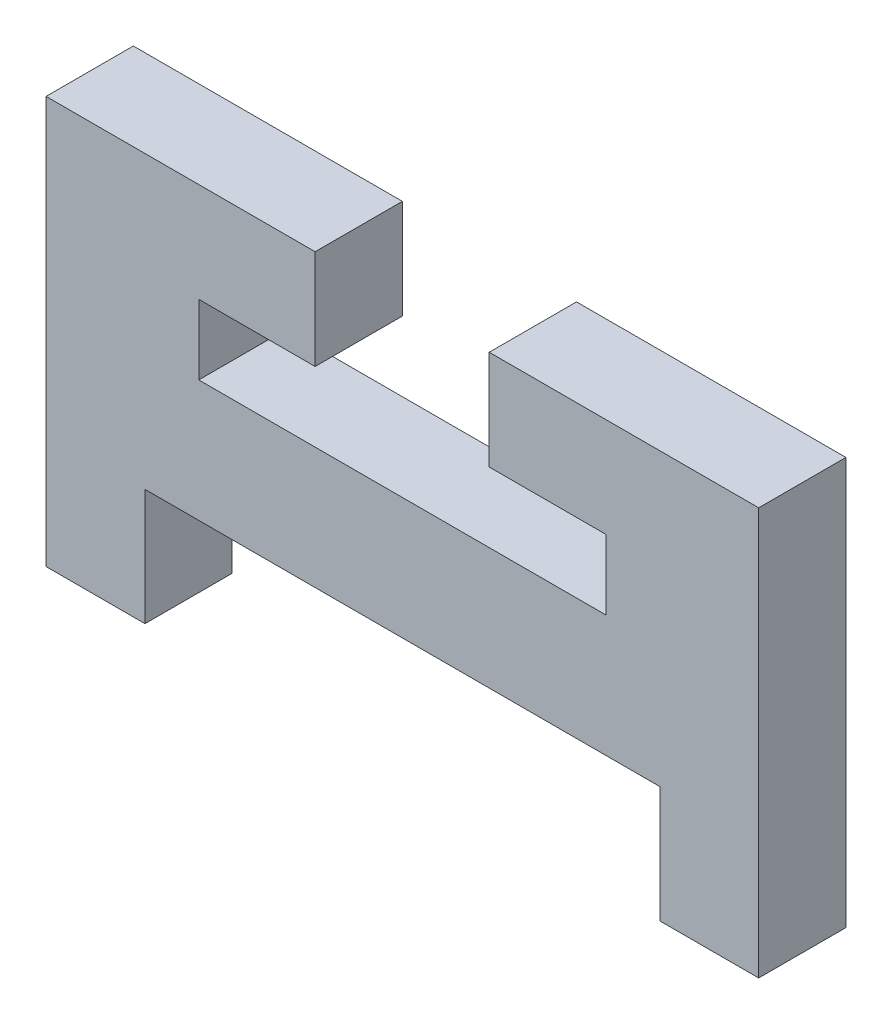
ISO-10303-21;
HEADER;
FILE_DESCRIPTION(('STEP AP214'),'2;1');
FILE_NAME('part.step','',(''),(''),'','','');
FILE_SCHEMA(('AUTOMOTIVE_DESIGN { 1 0 10303 214 1 1 1 1 }'));
ENDSEC;
DATA;
#1=APPLICATION_CONTEXT('core data for automotive mechanical design processes');
#2=APPLICATION_PROTOCOL_DEFINITION('international standard','automotive_design',2000,#1);
#3=PRODUCT_CONTEXT('',#1,'mechanical');
#4=PRODUCT('Part','Part','',(#3));
#5=PRODUCT_RELATED_PRODUCT_CATEGORY('part','',(#4));
#6=PRODUCT_DEFINITION_FORMATION('','',#4);
#7=PRODUCT_DEFINITION_CONTEXT('part definition',#1,'design');
#8=PRODUCT_DEFINITION('design','',#6,#7);
#9=PRODUCT_DEFINITION_SHAPE('','',#8);
#10=(LENGTH_UNIT() NAMED_UNIT(*) SI_UNIT(.MILLI.,.METRE.));
#11=(NAMED_UNIT(*) PLANE_ANGLE_UNIT() SI_UNIT($,.RADIAN.));
#12=(NAMED_UNIT(*) SI_UNIT($,.STERADIAN.) SOLID_ANGLE_UNIT());
#13=UNCERTAINTY_MEASURE_WITH_UNIT(LENGTH_MEASURE(1.E-05),#10,'distance_accuracy_value','');
#14=(GEOMETRIC_REPRESENTATION_CONTEXT(3) GLOBAL_UNCERTAINTY_ASSIGNED_CONTEXT((#13)) GLOBAL_UNIT_ASSIGNED_CONTEXT((#10,
#11,#12)) REPRESENTATION_CONTEXT('',''));
#15=CARTESIAN_POINT('',(0.,0.,0.));
#16=DIRECTION('',(0.,0.,1.));
#17=DIRECTION('',(1.,0.,0.));
#18=AXIS2_PLACEMENT_3D('',#15,#16,#17);
#19=CARTESIAN_POINT('',(46.92,30.0826832944775,3.));
#20=DIRECTION('',(0.,-1.,0.));
#21=DIRECTION('',(0.,0.,-1.));
#22=AXIS2_PLACEMENT_3D('',#19,#20,#21);
#23=PLANE('',#22);
#24=DIRECTION('',(-1.,0.,0.));
#25=VECTOR('',#24,1.);
#26=CARTESIAN_POINT('',(46.92,30.0826832944775,0.));
#27=LINE('',#26,#25);
#28=CARTESIAN_POINT('',(53.42,30.0826832944775,0.));
#29=VERTEX_POINT('',#28);
#30=CARTESIAN_POINT('',(39.42,30.0826832944775,0.));
#31=VERTEX_POINT('',#30);
#32=EDGE_CURVE('E109',#29,#31,#27,.T.);
#33=ORIENTED_EDGE('',*,*,#32,.T.);
#34=DIRECTION('',(0.,0.,-1.));
#35=VECTOR('',#34,1.);
#36=CARTESIAN_POINT('',(39.42,30.0826832944775,3.));
#37=LINE('',#36,#35);
#38=CARTESIAN_POINT('',(39.42,30.0826832944775,3.));
#39=VERTEX_POINT('',#38);
#40=EDGE_CURVE('E11',#39,#31,#37,.T.);
#41=ORIENTED_EDGE('',*,*,#40,.F.);
#42=DIRECTION('',(-1.,0.,0.));
#43=VECTOR('',#42,1.);
#44=CARTESIAN_POINT('',(53.42,30.0826832944775,3.));
#45=LINE('',#44,#43);
#46=CARTESIAN_POINT('',(53.42,30.0826832944775,3.));
#47=VERTEX_POINT('',#46);
#48=EDGE_CURVE('E115',#47,#39,#45,.T.);
#49=ORIENTED_EDGE('',*,*,#48,.F.);
#50=DIRECTION('',(0.,0.,-1.));
#51=VECTOR('',#50,1.);
#52=CARTESIAN_POINT('',(53.42,30.0826832944775,3.));
#53=LINE('',#52,#51);
#54=EDGE_CURVE('E173',#47,#29,#53,.T.);
#55=ORIENTED_EDGE('',*,*,#54,.T.);
#56=EDGE_LOOP('',(#33,#41,#49,#55));
#57=FACE_BOUND('',#56,.T.);
#58=ADVANCED_FACE('F33',(#57),#23,.F.);
#59=CARTESIAN_POINT('',(39.42,30.0826832944775,3.));
#60=DIRECTION('',(-1.,0.,0.));
#61=DIRECTION('',(0.,0.,1.));
#62=AXIS2_PLACEMENT_3D('',#59,#60,#61);
#63=PLANE('',#62);
#64=DIRECTION('',(0.,1.,0.));
#65=VECTOR('',#64,1.);
#66=CARTESIAN_POINT('',(39.42,30.0826832944775,0.));
#67=LINE('',#66,#65);
#68=CARTESIAN_POINT('',(39.42,32.4826832944775,0.));
#69=VERTEX_POINT('',#68);
#70=EDGE_CURVE('E178',#31,#69,#67,.T.);
#71=ORIENTED_EDGE('',*,*,#70,.T.);
#72=DIRECTION('',(0.,0.,-1.));
#73=VECTOR('',#72,1.);
#74=CARTESIAN_POINT('',(39.42,32.4826832944775,3.));
#75=LINE('',#74,#73);
#76=CARTESIAN_POINT('',(39.42,32.4826832944775,3.));
#77=VERTEX_POINT('',#76);
#78=EDGE_CURVE('E41',#77,#69,#75,.T.);
#79=ORIENTED_EDGE('',*,*,#78,.F.);
#80=DIRECTION('',(0.,1.,0.));
#81=VECTOR('',#80,1.);
#82=CARTESIAN_POINT('',(39.42,30.0826832944775,3.));
#83=LINE('',#82,#81);
#84=EDGE_CURVE('E294',#39,#77,#83,.T.);
#85=ORIENTED_EDGE('',*,*,#84,.F.);
#86=ORIENTED_EDGE('',*,*,#40,.T.);
#87=EDGE_LOOP('',(#71,#79,#85,#86));
#88=FACE_BOUND('',#87,.T.);
#89=ADVANCED_FACE('F297',(#88),#63,.F.);
#90=CARTESIAN_POINT('',(39.42,32.4826832944775,3.));
#91=DIRECTION('',(0.,1.,0.));
#92=DIRECTION('',(0.,0.,1.));
#93=AXIS2_PLACEMENT_3D('',#90,#91,#92);
#94=PLANE('',#93);
#95=DIRECTION('',(1.,0.,0.));
#96=VECTOR('',#95,1.);
#97=CARTESIAN_POINT('',(39.42,32.4826832944775,0.));
#98=LINE('',#97,#96);
#99=CARTESIAN_POINT('',(43.42,32.4826832944775,0.));
#100=VERTEX_POINT('',#99);
#101=EDGE_CURVE('E180',#69,#100,#98,.T.);
#102=ORIENTED_EDGE('',*,*,#101,.T.);
#103=DIRECTION('',(0.,0.,-1.));
#104=VECTOR('',#103,1.);
#105=CARTESIAN_POINT('',(43.42,32.4826832944775,3.));
#106=LINE('',#105,#104);
#107=CARTESIAN_POINT('',(43.42,32.4826832944775,3.));
#108=VERTEX_POINT('',#107);
#109=EDGE_CURVE('E237',#108,#100,#106,.T.);
#110=ORIENTED_EDGE('',*,*,#109,.F.);
#111=DIRECTION('',(1.,0.,0.));
#112=VECTOR('',#111,1.);
#113=CARTESIAN_POINT('',(39.42,32.4826832944775,3.));
#114=LINE('',#113,#112);
#115=EDGE_CURVE('E246',#77,#108,#114,.T.);
#116=ORIENTED_EDGE('',*,*,#115,.F.);
#117=ORIENTED_EDGE('',*,*,#78,.T.);
#118=EDGE_LOOP('',(#102,#110,#116,#117));
#119=FACE_BOUND('',#118,.T.);
#120=ADVANCED_FACE('F244',(#119),#94,.F.);
#121=CARTESIAN_POINT('',(43.42,32.4826832944775,3.));
#122=DIRECTION('',(-1.,0.,0.));
#123=DIRECTION('',(0.,0.,1.));
#124=AXIS2_PLACEMENT_3D('',#121,#122,#123);
#125=PLANE('',#124);
#126=DIRECTION('',(0.,1.,0.));
#127=VECTOR('',#126,1.);
#128=CARTESIAN_POINT('',(43.42,32.4826832944775,0.));
#129=LINE('',#128,#127);
#130=CARTESIAN_POINT('',(43.42,35.9,0.));
#131=VERTEX_POINT('',#130);
#132=EDGE_CURVE('E182',#100,#131,#129,.T.);
#133=ORIENTED_EDGE('',*,*,#132,.T.);
#134=DIRECTION('',(0.,0.,-1.));
#135=VECTOR('',#134,1.);
#136=CARTESIAN_POINT('',(43.42,35.9,3.));
#137=LINE('',#136,#135);
#138=CARTESIAN_POINT('',(43.42,35.9,3.));
#139=VERTEX_POINT('',#138);
#140=EDGE_CURVE('E234',#139,#131,#137,.T.);
#141=ORIENTED_EDGE('',*,*,#140,.F.);
#142=DIRECTION('',(0.,1.,0.));
#143=VECTOR('',#142,1.);
#144=CARTESIAN_POINT('',(43.42,32.4826832944775,3.));
#145=LINE('',#144,#143);
#146=EDGE_CURVE('E264',#108,#139,#145,.T.);
#147=ORIENTED_EDGE('',*,*,#146,.F.);
#148=ORIENTED_EDGE('',*,*,#109,.T.);
#149=EDGE_LOOP('',(#133,#141,#147,#148));
#150=FACE_BOUND('',#149,.T.);
#151=ADVANCED_FACE('F255',(#150),#125,.F.);
#152=CARTESIAN_POINT('',(43.42,35.9,3.));
#153=DIRECTION('',(0.,-1.,0.));
#154=DIRECTION('',(0.,0.,-1.));
#155=AXIS2_PLACEMENT_3D('',#152,#153,#154);
#156=PLANE('',#155);
#157=DIRECTION('',(-1.,0.,0.));
#158=VECTOR('',#157,1.);
#159=CARTESIAN_POINT('',(43.42,35.9,0.));
#160=LINE('',#159,#158);
#161=CARTESIAN_POINT('',(34.17,35.9,0.));
#162=VERTEX_POINT('',#161);
#163=EDGE_CURVE('E184',#131,#162,#160,.T.);
#164=ORIENTED_EDGE('',*,*,#163,.T.);
#165=DIRECTION('',(0.,0.,-1.));
#166=VECTOR('',#165,1.);
#167=CARTESIAN_POINT('',(34.17,35.9,3.));
#168=LINE('',#167,#166);
#169=CARTESIAN_POINT('',(34.17,35.9,3.));
#170=VERTEX_POINT('',#169);
#171=EDGE_CURVE('E231',#170,#162,#168,.T.);
#172=ORIENTED_EDGE('',*,*,#171,.F.);
#173=DIRECTION('',(-1.,0.,0.));
#174=VECTOR('',#173,1.);
#175=CARTESIAN_POINT('',(43.42,35.9,3.));
#176=LINE('',#175,#174);
#177=EDGE_CURVE('E261',#139,#170,#176,.T.);
#178=ORIENTED_EDGE('',*,*,#177,.F.);
#179=ORIENTED_EDGE('',*,*,#140,.T.);
#180=EDGE_LOOP('',(#164,#172,#178,#179));
#181=FACE_BOUND('',#180,.T.);
#182=ADVANCED_FACE('F259',(#181),#156,.F.);
#183=CARTESIAN_POINT('',(34.17,35.9,3.));
#184=DIRECTION('',(1.,0.,0.));
#185=DIRECTION('',(0.,0.,-1.));
#186=AXIS2_PLACEMENT_3D('',#183,#184,#185);
#187=PLANE('',#186);
#188=DIRECTION('',(0.,-1.,0.));
#189=VECTOR('',#188,1.);
#190=CARTESIAN_POINT('',(34.17,35.9,0.));
#191=LINE('',#190,#189);
#192=CARTESIAN_POINT('',(34.17,21.9,0.));
#193=VERTEX_POINT('',#192);
#194=EDGE_CURVE('E186',#162,#193,#191,.T.);
#195=ORIENTED_EDGE('',*,*,#194,.T.);
#196=DIRECTION('',(0.,0.,-1.));
#197=VECTOR('',#196,1.);
#198=CARTESIAN_POINT('',(34.17,21.9,3.));
#199=LINE('',#198,#197);
#200=CARTESIAN_POINT('',(34.17,21.9,3.));
#201=VERTEX_POINT('',#200);
#202=EDGE_CURVE('E228',#201,#193,#199,.T.);
#203=ORIENTED_EDGE('',*,*,#202,.F.);
#204=DIRECTION('',(0.,-1.,0.));
#205=VECTOR('',#204,1.);
#206=CARTESIAN_POINT('',(34.17,35.9,3.));
#207=LINE('',#206,#205);
#208=EDGE_CURVE('E263',#170,#201,#207,.T.);
#209=ORIENTED_EDGE('',*,*,#208,.F.);
#210=ORIENTED_EDGE('',*,*,#171,.T.);
#211=EDGE_LOOP('',(#195,#203,#209,#210));
#212=FACE_BOUND('',#211,.T.);
#213=ADVANCED_FACE('F309',(#212),#187,.F.);
#214=CARTESIAN_POINT('',(34.17,21.9,3.));
#215=DIRECTION('',(0.,1.,0.));
#216=DIRECTION('',(0.,0.,1.));
#217=AXIS2_PLACEMENT_3D('',#214,#215,#216);
#218=PLANE('',#217);
#219=DIRECTION('',(1.,0.,0.));
#220=VECTOR('',#219,1.);
#221=CARTESIAN_POINT('',(34.17,21.9,0.));
#222=LINE('',#221,#220);
#223=CARTESIAN_POINT('',(37.57,21.9,0.));
#224=VERTEX_POINT('',#223);
#225=EDGE_CURVE('E188',#193,#224,#222,.T.);
#226=ORIENTED_EDGE('',*,*,#225,.T.);
#227=DIRECTION('',(0.,0.,-1.));
#228=VECTOR('',#227,1.);
#229=CARTESIAN_POINT('',(37.57,21.9,3.));
#230=LINE('',#229,#228);
#231=CARTESIAN_POINT('',(37.57,21.9,3.));
#232=VERTEX_POINT('',#231);
#233=EDGE_CURVE('E225',#232,#224,#230,.T.);
#234=ORIENTED_EDGE('',*,*,#233,.F.);
#235=DIRECTION('',(1.,0.,0.));
#236=VECTOR('',#235,1.);
#237=CARTESIAN_POINT('',(34.17,21.9,3.));
#238=LINE('',#237,#236);
#239=EDGE_CURVE('E266',#201,#232,#238,.T.);
#240=ORIENTED_EDGE('',*,*,#239,.F.);
#241=ORIENTED_EDGE('',*,*,#202,.T.);
#242=EDGE_LOOP('',(#226,#234,#240,#241));
#243=FACE_BOUND('',#242,.T.);
#244=ADVANCED_FACE('F312',(#243),#218,.F.);
#245=CARTESIAN_POINT('',(37.57,21.9,3.));
#246=DIRECTION('',(-1.,0.,0.));
#247=DIRECTION('',(0.,0.,1.));
#248=AXIS2_PLACEMENT_3D('',#245,#246,#247);
#249=PLANE('',#248);
#250=DIRECTION('',(0.,1.,0.));
#251=VECTOR('',#250,1.);
#252=CARTESIAN_POINT('',(37.57,21.9,0.));
#253=LINE('',#252,#251);
#254=CARTESIAN_POINT('',(37.57,25.9,0.));
#255=VERTEX_POINT('',#254);
#256=EDGE_CURVE('E190',#224,#255,#253,.T.);
#257=ORIENTED_EDGE('',*,*,#256,.T.);
#258=DIRECTION('',(0.,0.,-1.));
#259=VECTOR('',#258,1.);
#260=CARTESIAN_POINT('',(37.57,25.9,3.));
#261=LINE('',#260,#259);
#262=CARTESIAN_POINT('',(37.57,25.9,3.));
#263=VERTEX_POINT('',#262);
#264=EDGE_CURVE('E222',#263,#255,#261,.T.);
#265=ORIENTED_EDGE('',*,*,#264,.F.);
#266=DIRECTION('',(0.,1.,0.));
#267=VECTOR('',#266,1.);
#268=CARTESIAN_POINT('',(37.57,21.9,3.));
#269=LINE('',#268,#267);
#270=EDGE_CURVE('E272',#232,#263,#269,.T.);
#271=ORIENTED_EDGE('',*,*,#270,.F.);
#272=ORIENTED_EDGE('',*,*,#233,.T.);
#273=EDGE_LOOP('',(#257,#265,#271,#272));
#274=FACE_BOUND('',#273,.T.);
#275=ADVANCED_FACE('F316',(#274),#249,.F.);
#276=CARTESIAN_POINT('',(37.57,25.9,3.));
#277=DIRECTION('',(0.,1.,0.));
#278=DIRECTION('',(0.,0.,1.));
#279=AXIS2_PLACEMENT_3D('',#276,#277,#278);
#280=PLANE('',#279);
#281=DIRECTION('',(1.,0.,0.));
#282=VECTOR('',#281,1.);
#283=CARTESIAN_POINT('',(37.57,25.9,0.));
#284=LINE('',#283,#282);
#285=CARTESIAN_POINT('',(55.27,25.9,0.));
#286=VERTEX_POINT('',#285);
#287=EDGE_CURVE('E192',#255,#286,#284,.T.);
#288=ORIENTED_EDGE('',*,*,#287,.T.);
#289=DIRECTION('',(0.,0.,-1.));
#290=VECTOR('',#289,1.);
#291=CARTESIAN_POINT('',(55.27,25.9,3.));
#292=LINE('',#291,#290);
#293=CARTESIAN_POINT('',(55.27,25.9,3.));
#294=VERTEX_POINT('',#293);
#295=EDGE_CURVE('E219',#294,#286,#292,.T.);
#296=ORIENTED_EDGE('',*,*,#295,.F.);
#297=DIRECTION('',(1.,0.,0.));
#298=VECTOR('',#297,1.);
#299=CARTESIAN_POINT('',(37.57,25.9,3.));
#300=LINE('',#299,#298);
#301=EDGE_CURVE('E274',#263,#294,#300,.T.);
#302=ORIENTED_EDGE('',*,*,#301,.F.);
#303=ORIENTED_EDGE('',*,*,#264,.T.);
#304=EDGE_LOOP('',(#288,#296,#302,#303));
#305=FACE_BOUND('',#304,.T.);
#306=ADVANCED_FACE('F320',(#305),#280,.F.);
#307=CARTESIAN_POINT('',(55.27,25.9,3.));
#308=DIRECTION('',(1.,0.,0.));
#309=DIRECTION('',(0.,0.,-1.));
#310=AXIS2_PLACEMENT_3D('',#307,#308,#309);
#311=PLANE('',#310);
#312=DIRECTION('',(0.,-1.,0.));
#313=VECTOR('',#312,1.);
#314=CARTESIAN_POINT('',(55.27,25.9,0.));
#315=LINE('',#314,#313);
#316=CARTESIAN_POINT('',(55.27,21.9,0.));
#317=VERTEX_POINT('',#316);
#318=EDGE_CURVE('E194',#286,#317,#315,.T.);
#319=ORIENTED_EDGE('',*,*,#318,.T.);
#320=DIRECTION('',(0.,0.,-1.));
#321=VECTOR('',#320,1.);
#322=CARTESIAN_POINT('',(55.27,21.9,3.));
#323=LINE('',#322,#321);
#324=CARTESIAN_POINT('',(55.27,21.9,3.));
#325=VERTEX_POINT('',#324);
#326=EDGE_CURVE('E216',#325,#317,#323,.T.);
#327=ORIENTED_EDGE('',*,*,#326,.F.);
#328=DIRECTION('',(0.,-1.,0.));
#329=VECTOR('',#328,1.);
#330=CARTESIAN_POINT('',(55.27,25.9,3.));
#331=LINE('',#330,#329);
#332=EDGE_CURVE('E276',#294,#325,#331,.T.);
#333=ORIENTED_EDGE('',*,*,#332,.F.);
#334=ORIENTED_EDGE('',*,*,#295,.T.);
#335=EDGE_LOOP('',(#319,#327,#333,#334));
#336=FACE_BOUND('',#335,.T.);
#337=ADVANCED_FACE('F324',(#336),#311,.F.);
#338=CARTESIAN_POINT('',(55.27,21.9,3.));
#339=DIRECTION('',(0.,1.,0.));
#340=DIRECTION('',(0.,0.,1.));
#341=AXIS2_PLACEMENT_3D('',#338,#339,#340);
#342=PLANE('',#341);
#343=DIRECTION('',(1.,0.,0.));
#344=VECTOR('',#343,1.);
#345=CARTESIAN_POINT('',(55.27,21.9,0.));
#346=LINE('',#345,#344);
#347=CARTESIAN_POINT('',(58.67,21.9,0.));
#348=VERTEX_POINT('',#347);
#349=EDGE_CURVE('E196',#317,#348,#346,.T.);
#350=ORIENTED_EDGE('',*,*,#349,.T.);
#351=DIRECTION('',(0.,0.,-1.));
#352=VECTOR('',#351,1.);
#353=CARTESIAN_POINT('',(58.67,21.9,3.));
#354=LINE('',#353,#352);
#355=CARTESIAN_POINT('',(58.67,21.9,3.));
#356=VERTEX_POINT('',#355);
#357=EDGE_CURVE('E213',#356,#348,#354,.T.);
#358=ORIENTED_EDGE('',*,*,#357,.F.);
#359=DIRECTION('',(1.,0.,0.));
#360=VECTOR('',#359,1.);
#361=CARTESIAN_POINT('',(55.27,21.9,3.));
#362=LINE('',#361,#360);
#363=EDGE_CURVE('E278',#325,#356,#362,.T.);
#364=ORIENTED_EDGE('',*,*,#363,.F.);
#365=ORIENTED_EDGE('',*,*,#326,.T.);
#366=EDGE_LOOP('',(#350,#358,#364,#365));
#367=FACE_BOUND('',#366,.T.);
#368=ADVANCED_FACE('F328',(#367),#342,.F.);
#369=CARTESIAN_POINT('',(58.67,21.9,3.));
#370=DIRECTION('',(-1.,0.,0.));
#371=DIRECTION('',(0.,0.,1.));
#372=AXIS2_PLACEMENT_3D('',#369,#370,#371);
#373=PLANE('',#372);
#374=DIRECTION('',(0.,1.,0.));
#375=VECTOR('',#374,1.);
#376=CARTESIAN_POINT('',(58.67,21.9,0.));
#377=LINE('',#376,#375);
#378=CARTESIAN_POINT('',(58.67,35.9,0.));
#379=VERTEX_POINT('',#378);
#380=EDGE_CURVE('E198',#348,#379,#377,.T.);
#381=ORIENTED_EDGE('',*,*,#380,.T.);
#382=DIRECTION('',(0.,0.,-1.));
#383=VECTOR('',#382,1.);
#384=CARTESIAN_POINT('',(58.67,35.9,3.));
#385=LINE('',#384,#383);
#386=CARTESIAN_POINT('',(58.67,35.9,3.));
#387=VERTEX_POINT('',#386);
#388=EDGE_CURVE('E210',#387,#379,#385,.T.);
#389=ORIENTED_EDGE('',*,*,#388,.F.);
#390=DIRECTION('',(0.,1.,0.));
#391=VECTOR('',#390,1.);
#392=CARTESIAN_POINT('',(58.67,21.9,3.));
#393=LINE('',#392,#391);
#394=EDGE_CURVE('E280',#356,#387,#393,.T.);
#395=ORIENTED_EDGE('',*,*,#394,.F.);
#396=ORIENTED_EDGE('',*,*,#357,.T.);
#397=EDGE_LOOP('',(#381,#389,#395,#396));
#398=FACE_BOUND('',#397,.T.);
#399=ADVANCED_FACE('F286',(#398),#373,.F.);
#400=CARTESIAN_POINT('',(58.67,35.9,3.));
#401=DIRECTION('',(0.,-1.,0.));
#402=DIRECTION('',(0.,0.,-1.));
#403=AXIS2_PLACEMENT_3D('',#400,#401,#402);
#404=PLANE('',#403);
#405=DIRECTION('',(-1.,0.,0.));
#406=VECTOR('',#405,1.);
#407=CARTESIAN_POINT('',(58.67,35.9,0.));
#408=LINE('',#407,#406);
#409=CARTESIAN_POINT('',(49.4063854020223,35.9,0.));
#410=VERTEX_POINT('',#409);
#411=EDGE_CURVE('E200',#379,#410,#408,.T.);
#412=ORIENTED_EDGE('',*,*,#411,.T.);
#413=DIRECTION('',(0.,0.,-1.));
#414=VECTOR('',#413,1.);
#415=CARTESIAN_POINT('',(49.4063854020223,35.9,3.));
#416=LINE('',#415,#414);
#417=CARTESIAN_POINT('',(49.4063854020223,35.9,3.));
#418=VERTEX_POINT('',#417);
#419=EDGE_CURVE('E168',#418,#410,#416,.T.);
#420=ORIENTED_EDGE('',*,*,#419,.F.);
#421=DIRECTION('',(-1.,0.,0.));
#422=VECTOR('',#421,1.);
#423=CARTESIAN_POINT('',(58.67,35.9,3.));
#424=LINE('',#423,#422);
#425=EDGE_CURVE('E159',#387,#418,#424,.T.);
#426=ORIENTED_EDGE('',*,*,#425,.F.);
#427=ORIENTED_EDGE('',*,*,#388,.T.);
#428=EDGE_LOOP('',(#412,#420,#426,#427));
#429=FACE_BOUND('',#428,.T.);
#430=ADVANCED_FACE('F290',(#429),#404,.F.);
#431=CARTESIAN_POINT('',(49.4063854020223,35.9,3.));
#432=DIRECTION('',(1.,0.,0.));
#433=DIRECTION('',(0.,0.,-1.));
#434=AXIS2_PLACEMENT_3D('',#431,#432,#433);
#435=PLANE('',#434);
#436=DIRECTION('',(0.,-1.,0.));
#437=VECTOR('',#436,1.);
#438=CARTESIAN_POINT('',(49.4063854020223,35.9,0.));
#439=LINE('',#438,#437);
#440=CARTESIAN_POINT('',(49.4063854020223,32.4826832944775,0.));
#441=VERTEX_POINT('',#440);
#442=EDGE_CURVE('E167',#410,#441,#439,.T.);
#443=ORIENTED_EDGE('',*,*,#442,.T.);
#444=DIRECTION('',(0.,0.,-1.));
#445=VECTOR('',#444,1.);
#446=CARTESIAN_POINT('',(49.4063854020223,32.4826832944775,3.));
#447=LINE('',#446,#445);
#448=CARTESIAN_POINT('',(49.4063854020223,32.4826832944775,3.));
#449=VERTEX_POINT('',#448);
#450=EDGE_CURVE('E164',#449,#441,#447,.T.);
#451=ORIENTED_EDGE('',*,*,#450,.F.);
#452=DIRECTION('',(0.,-1.,0.));
#453=VECTOR('',#452,1.);
#454=CARTESIAN_POINT('',(49.4063854020223,35.9,3.));
#455=LINE('',#454,#453);
#456=EDGE_CURVE('E153',#418,#449,#455,.T.);
#457=ORIENTED_EDGE('',*,*,#456,.F.);
#458=ORIENTED_EDGE('',*,*,#419,.T.);
#459=EDGE_LOOP('',(#443,#451,#457,#458));
#460=FACE_BOUND('',#459,.T.);
#461=ADVANCED_FACE('F165',(#460),#435,.F.);
#462=CARTESIAN_POINT('',(49.4063854020223,32.4826832944775,3.));
#463=DIRECTION('',(0.,1.,0.));
#464=DIRECTION('',(0.,0.,1.));
#465=AXIS2_PLACEMENT_3D('',#462,#463,#464);
#466=PLANE('',#465);
#467=DIRECTION('',(1.,0.,0.));
#468=VECTOR('',#467,1.);
#469=CARTESIAN_POINT('',(49.4063854020223,32.4826832944775,0.));
#470=LINE('',#469,#468);
#471=CARTESIAN_POINT('',(53.42,32.4826832944775,0.));
#472=VERTEX_POINT('',#471);
#473=EDGE_CURVE('E102',#441,#472,#470,.T.);
#474=ORIENTED_EDGE('',*,*,#473,.T.);
#475=DIRECTION('',(0.,0.,-1.));
#476=VECTOR('',#475,1.);
#477=CARTESIAN_POINT('',(53.42,32.4826832944775,3.));
#478=LINE('',#477,#476);
#479=CARTESIAN_POINT('',(53.42,32.4826832944775,3.));
#480=VERTEX_POINT('',#479);
#481=EDGE_CURVE('E169',#480,#472,#478,.T.);
#482=ORIENTED_EDGE('',*,*,#481,.F.);
#483=DIRECTION('',(1.,0.,0.));
#484=VECTOR('',#483,1.);
#485=CARTESIAN_POINT('',(49.4063854020223,32.4826832944775,3.));
#486=LINE('',#485,#484);
#487=EDGE_CURVE('E157',#449,#480,#486,.T.);
#488=ORIENTED_EDGE('',*,*,#487,.F.);
#489=ORIENTED_EDGE('',*,*,#450,.T.);
#490=EDGE_LOOP('',(#474,#482,#488,#489));
#491=FACE_BOUND('',#490,.T.);
#492=ADVANCED_FACE('F171',(#491),#466,.F.);
#493=CARTESIAN_POINT('',(53.42,32.4826832944775,3.));
#494=DIRECTION('',(1.,0.,0.));
#495=DIRECTION('',(0.,0.,-1.));
#496=AXIS2_PLACEMENT_3D('',#493,#494,#495);
#497=PLANE('',#496);
#498=DIRECTION('',(0.,-1.,0.));
#499=VECTOR('',#498,1.);
#500=CARTESIAN_POINT('',(53.42,32.4826832944775,0.));
#501=LINE('',#500,#499);
#502=EDGE_CURVE('E204',#472,#29,#501,.T.);
#503=ORIENTED_EDGE('',*,*,#502,.T.);
#504=ORIENTED_EDGE('',*,*,#54,.F.);
#505=DIRECTION('',(0.,-1.,0.));
#506=VECTOR('',#505,1.);
#507=CARTESIAN_POINT('',(53.42,32.4826832944775,3.));
#508=LINE('',#507,#506);
#509=EDGE_CURVE('E49',#480,#47,#508,.T.);
#510=ORIENTED_EDGE('',*,*,#509,.F.);
#511=ORIENTED_EDGE('',*,*,#481,.T.);
#512=EDGE_LOOP('',(#503,#504,#510,#511));
#513=FACE_BOUND('',#512,.T.);
#514=ADVANCED_FACE('F292',(#513),#497,.F.);
#515=CARTESIAN_POINT('',(0.,0.,3.));
#516=DIRECTION('',(0.,0.,-1.));
#517=DIRECTION('',(-1.,0.,0.));
#518=AXIS2_PLACEMENT_3D('',#515,#516,#517);
#519=PLANE('',#518);
#520=ORIENTED_EDGE('',*,*,#48,.T.);
#521=ORIENTED_EDGE('',*,*,#84,.T.);
#522=ORIENTED_EDGE('',*,*,#115,.T.);
#523=ORIENTED_EDGE('',*,*,#146,.T.);
#524=ORIENTED_EDGE('',*,*,#177,.T.);
#525=ORIENTED_EDGE('',*,*,#208,.T.);
#526=ORIENTED_EDGE('',*,*,#239,.T.);
#527=ORIENTED_EDGE('',*,*,#270,.T.);
#528=ORIENTED_EDGE('',*,*,#301,.T.);
#529=ORIENTED_EDGE('',*,*,#332,.T.);
#530=ORIENTED_EDGE('',*,*,#363,.T.);
#531=ORIENTED_EDGE('',*,*,#394,.T.);
#532=ORIENTED_EDGE('',*,*,#425,.T.);
#533=ORIENTED_EDGE('',*,*,#456,.T.);
#534=ORIENTED_EDGE('',*,*,#487,.T.);
#535=ORIENTED_EDGE('',*,*,#509,.T.);
#536=EDGE_LOOP('',(#520,#521,#522,#523,#524,#525,#526,#527,#528,#529,#530,#531,#532,#533,#534,#535));
#537=FACE_BOUND('',#536,.T.);
#538=ADVANCED_FACE('F155',(#537),#519,.F.);
#539=CARTESIAN_POINT('',(0.,0.,0.));
#540=DIRECTION('',(0.,0.,-1.));
#541=DIRECTION('',(-1.,0.,0.));
#542=AXIS2_PLACEMENT_3D('',#539,#540,#541);
#543=PLANE('',#542);
#544=ORIENTED_EDGE('',*,*,#32,.F.);
#545=ORIENTED_EDGE('',*,*,#502,.F.);
#546=ORIENTED_EDGE('',*,*,#473,.F.);
#547=ORIENTED_EDGE('',*,*,#442,.F.);
#548=ORIENTED_EDGE('',*,*,#411,.F.);
#549=ORIENTED_EDGE('',*,*,#380,.F.);
#550=ORIENTED_EDGE('',*,*,#349,.F.);
#551=ORIENTED_EDGE('',*,*,#318,.F.);
#552=ORIENTED_EDGE('',*,*,#287,.F.);
#553=ORIENTED_EDGE('',*,*,#256,.F.);
#554=ORIENTED_EDGE('',*,*,#225,.F.);
#555=ORIENTED_EDGE('',*,*,#194,.F.);
#556=ORIENTED_EDGE('',*,*,#163,.F.);
#557=ORIENTED_EDGE('',*,*,#132,.F.);
#558=ORIENTED_EDGE('',*,*,#101,.F.);
#559=ORIENTED_EDGE('',*,*,#70,.F.);
#560=EDGE_LOOP('',(#544,#545,#546,#547,#548,#549,#550,#551,#552,#553,#554,#555,#556,#557,#558,#559));
#561=FACE_BOUND('',#560,.T.);
#562=ADVANCED_FACE('F250',(#561),#543,.T.);
#563=CLOSED_SHELL('',(#58,#89,#120,#151,#182,#213,#244,#275,#306,#337,#368,#399,#430,#461,#492,
#514,#538,#562));
#564=MANIFOLD_SOLID_BREP('B2',#563);
#565=ADVANCED_BREP_SHAPE_REPRESENTATION('',(#18,#564),#14);
#566=SHAPE_DEFINITION_REPRESENTATION(#9,#565);
ENDSEC;
END-ISO-10303-21;
